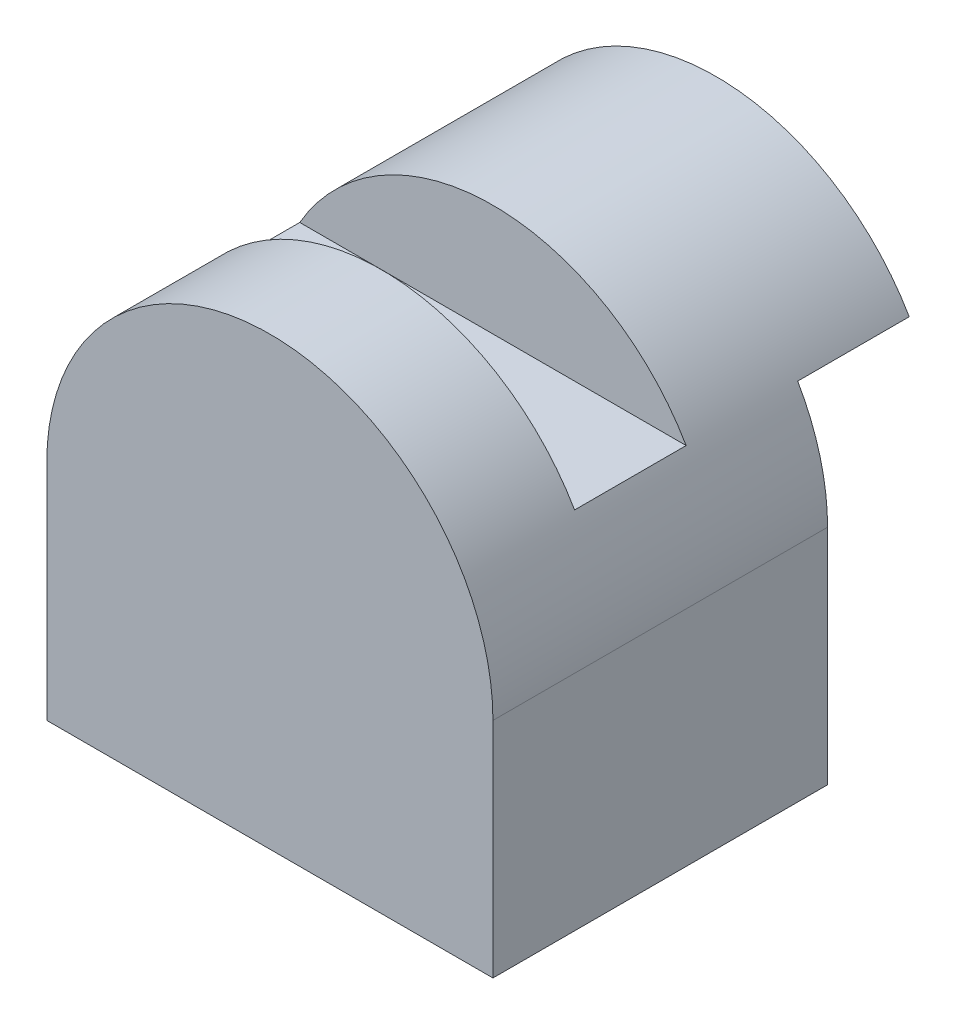
ISO-10303-21;
HEADER;
FILE_DESCRIPTION(('STEP AP214'),'2;1');
FILE_NAME('part.step','',(''),(''),'','','');
FILE_SCHEMA(('AUTOMOTIVE_DESIGN { 1 0 10303 214 1 1 1 1 }'));
ENDSEC;
DATA;
#1=APPLICATION_CONTEXT('core data for automotive mechanical design processes');
#2=APPLICATION_PROTOCOL_DEFINITION('international standard','automotive_design',2000,#1);
#3=PRODUCT_CONTEXT('',#1,'mechanical');
#4=PRODUCT('Part','Part','',(#3));
#5=PRODUCT_RELATED_PRODUCT_CATEGORY('part','',(#4));
#6=PRODUCT_DEFINITION_FORMATION('','',#4);
#7=PRODUCT_DEFINITION_CONTEXT('part definition',#1,'design');
#8=PRODUCT_DEFINITION('design','',#6,#7);
#9=PRODUCT_DEFINITION_SHAPE('','',#8);
#10=(LENGTH_UNIT() NAMED_UNIT(*) SI_UNIT(.MILLI.,.METRE.));
#11=(NAMED_UNIT(*) PLANE_ANGLE_UNIT() SI_UNIT($,.RADIAN.));
#12=(NAMED_UNIT(*) SI_UNIT($,.STERADIAN.) SOLID_ANGLE_UNIT());
#13=UNCERTAINTY_MEASURE_WITH_UNIT(LENGTH_MEASURE(1.E-05),#10,'distance_accuracy_value','');
#14=(GEOMETRIC_REPRESENTATION_CONTEXT(3) GLOBAL_UNCERTAINTY_ASSIGNED_CONTEXT((#13)) GLOBAL_UNIT_ASSIGNED_CONTEXT((#10,
#11,#12)) REPRESENTATION_CONTEXT('',''));
#15=CARTESIAN_POINT('',(0.,0.,0.));
#16=DIRECTION('',(0.,0.,1.));
#17=DIRECTION('',(1.,0.,0.));
#18=AXIS2_PLACEMENT_3D('',#15,#16,#17);
#19=CARTESIAN_POINT('',(0.,0.,40.));
#20=DIRECTION('',(0.,0.,-1.));
#21=DIRECTION('',(-1.,0.,0.));
#22=AXIS2_PLACEMENT_3D('',#19,#20,#21);
#23=CYLINDRICAL_SURFACE('',#22,20.);
#24=DIRECTION('',(0.,0.,-1.));
#25=VECTOR('',#24,1.);
#26=CARTESIAN_POINT('',(17.3205080756888,9.99999999999999,40.));
#27=LINE('',#26,#25);
#28=CARTESIAN_POINT('',(17.3205080756888,9.99999999999999,0.));
#29=VERTEX_POINT('',#28);
#30=CARTESIAN_POINT('',(17.3205080756888,9.99999999999999,10.));
#31=VERTEX_POINT('',#30);
#32=EDGE_CURVE('E147',#29,#31,#27,.F.);
#33=ORIENTED_EDGE('',*,*,#32,.F.);
#34=CARTESIAN_POINT('',(0.,0.,0.));
#35=DIRECTION('',(0.,0.,1.));
#36=DIRECTION('',(-1.,0.,0.));
#37=AXIS2_PLACEMENT_3D('',#34,#35,#36);
#38=CIRCLE('',#37,20.);
#39=CARTESIAN_POINT('',(-17.3205080756888,9.99999999999999,0.));
#40=VERTEX_POINT('',#39);
#41=EDGE_CURVE('E130',#29,#40,#38,.T.);
#42=ORIENTED_EDGE('',*,*,#41,.T.);
#43=DIRECTION('',(0.,0.,-1.));
#44=VECTOR('',#43,1.);
#45=CARTESIAN_POINT('',(-17.3205080756888,9.99999999999999,40.));
#46=LINE('',#45,#44);
#47=CARTESIAN_POINT('',(-17.3205080756888,9.99999999999999,10.));
#48=VERTEX_POINT('',#47);
#49=EDGE_CURVE('E54',#48,#40,#46,.T.);
#50=ORIENTED_EDGE('',*,*,#49,.F.);
#51=CARTESIAN_POINT('',(0.,0.,10.));
#52=DIRECTION('',(0.,0.,-1.));
#53=DIRECTION('',(-1.,0.,0.));
#54=AXIS2_PLACEMENT_3D('',#51,#52,#53);
#55=CIRCLE('',#54,20.);
#56=CARTESIAN_POINT('',(-20.,0.,10.));
#57=VERTEX_POINT('',#56);
#58=EDGE_CURVE('E134',#57,#48,#55,.T.);
#59=ORIENTED_EDGE('',*,*,#58,.F.);
#60=DIRECTION('',(0.,0.,-1.));
#61=VECTOR('',#60,1.);
#62=CARTESIAN_POINT('',(-20.,0.,40.));
#63=LINE('',#62,#61);
#64=CARTESIAN_POINT('',(-20.,0.,40.));
#65=VERTEX_POINT('',#64);
#66=EDGE_CURVE('E117',#65,#57,#63,.T.);
#67=ORIENTED_EDGE('',*,*,#66,.F.);
#68=CARTESIAN_POINT('',(0.,0.,40.));
#69=DIRECTION('',(0.,0.,1.));
#70=DIRECTION('',(-1.,0.,0.));
#71=AXIS2_PLACEMENT_3D('',#68,#69,#70);
#72=CIRCLE('',#71,20.);
#73=CARTESIAN_POINT('',(20.,0.,40.));
#74=VERTEX_POINT('',#73);
#75=EDGE_CURVE('E133',#74,#65,#72,.T.);
#76=ORIENTED_EDGE('',*,*,#75,.F.);
#77=DIRECTION('',(0.,0.,-1.));
#78=VECTOR('',#77,1.);
#79=CARTESIAN_POINT('',(20.,0.,40.));
#80=LINE('',#79,#78);
#81=CARTESIAN_POINT('',(20.,0.,10.));
#82=VERTEX_POINT('',#81);
#83=EDGE_CURVE('E126',#74,#82,#80,.T.);
#84=ORIENTED_EDGE('',*,*,#83,.T.);
#85=EDGE_CURVE('E144',#31,#82,#55,.T.);
#86=ORIENTED_EDGE('',*,*,#85,.F.);
#87=EDGE_LOOP('',(#33,#42,#50,#59,#67,#76,#84,#86));
#88=FACE_BOUND('',#87,.T.);
#89=DIRECTION('',(0.,0.,-1.));
#90=VECTOR('',#89,1.);
#91=CARTESIAN_POINT('',(17.3205080756888,10.,40.));
#92=LINE('',#91,#90);
#93=CARTESIAN_POINT('',(17.3205080756888,10.,30.));
#94=VERTEX_POINT('',#93);
#95=CARTESIAN_POINT('',(17.3205080756888,10.,20.));
#96=VERTEX_POINT('',#95);
#97=EDGE_CURVE('E11',#94,#96,#92,.T.);
#98=ORIENTED_EDGE('',*,*,#97,.F.);
#99=CARTESIAN_POINT('',(0.,0.,30.));
#100=DIRECTION('',(0.,0.,-1.));
#101=DIRECTION('',(0.,1.,0.));
#102=AXIS2_PLACEMENT_3D('',#99,#100,#101);
#103=CIRCLE('',#102,20.);
#104=CARTESIAN_POINT('',(-17.3205080756888,10.,30.));
#105=VERTEX_POINT('',#104);
#106=EDGE_CURVE('E98',#105,#94,#103,.T.);
#107=ORIENTED_EDGE('',*,*,#106,.F.);
#108=DIRECTION('',(0.,0.,-1.));
#109=VECTOR('',#108,1.);
#110=CARTESIAN_POINT('',(-17.3205080756888,10.,40.));
#111=LINE('',#110,#109);
#112=CARTESIAN_POINT('',(-17.3205080756888,10.,20.));
#113=VERTEX_POINT('',#112);
#114=EDGE_CURVE('E105',#113,#105,#111,.F.);
#115=ORIENTED_EDGE('',*,*,#114,.F.);
#116=CARTESIAN_POINT('',(0.,0.,20.));
#117=DIRECTION('',(0.,0.,1.));
#118=DIRECTION('',(1.,0.,0.));
#119=AXIS2_PLACEMENT_3D('',#116,#117,#118);
#120=CIRCLE('',#119,20.);
#121=EDGE_CURVE('E40',#96,#113,#120,.T.);
#122=ORIENTED_EDGE('',*,*,#121,.F.);
#123=EDGE_LOOP('',(#98,#107,#115,#122));
#124=FACE_BOUND('',#123,.T.);
#125=ADVANCED_FACE('F33',(#88,#124),#23,.T.);
#126=CARTESIAN_POINT('',(-20.,0.,40.));
#127=DIRECTION('',(1.,0.,0.));
#128=DIRECTION('',(0.,0.,-1.));
#129=AXIS2_PLACEMENT_3D('',#126,#127,#128);
#130=PLANE('',#129);
#131=DIRECTION('',(0.,1.,0.));
#132=VECTOR('',#131,1.);
#133=CARTESIAN_POINT('',(-20.,0.,10.));
#134=LINE('',#133,#132);
#135=CARTESIAN_POINT('',(-20.,-20.,10.));
#136=VERTEX_POINT('',#135);
#137=EDGE_CURVE('E142',#136,#57,#134,.T.);
#138=ORIENTED_EDGE('',*,*,#137,.F.);
#139=DIRECTION('',(0.,0.,-1.));
#140=VECTOR('',#139,1.);
#141=CARTESIAN_POINT('',(-20.,-20.,40.));
#142=LINE('',#141,#140);
#143=CARTESIAN_POINT('',(-20.,-20.,40.));
#144=VERTEX_POINT('',#143);
#145=EDGE_CURVE('E120',#144,#136,#142,.T.);
#146=ORIENTED_EDGE('',*,*,#145,.F.);
#147=DIRECTION('',(0.,-1.,0.));
#148=VECTOR('',#147,1.);
#149=CARTESIAN_POINT('',(-20.,0.,40.));
#150=LINE('',#149,#148);
#151=EDGE_CURVE('E138',#65,#144,#150,.T.);
#152=ORIENTED_EDGE('',*,*,#151,.F.);
#153=ORIENTED_EDGE('',*,*,#66,.T.);
#154=EDGE_LOOP('',(#138,#146,#152,#153));
#155=FACE_BOUND('',#154,.T.);
#156=ADVANCED_FACE('F162',(#155),#130,.F.);
#157=CARTESIAN_POINT('',(-20.,-20.,40.));
#158=DIRECTION('',(0.,1.,0.));
#159=DIRECTION('',(0.,0.,1.));
#160=AXIS2_PLACEMENT_3D('',#157,#158,#159);
#161=PLANE('',#160);
#162=DIRECTION('',(-1.,0.,0.));
#163=VECTOR('',#162,1.);
#164=CARTESIAN_POINT('',(40.,-20.,10.));
#165=LINE('',#164,#163);
#166=CARTESIAN_POINT('',(20.,-20.,10.));
#167=VERTEX_POINT('',#166);
#168=EDGE_CURVE('E108',#167,#136,#165,.T.);
#169=ORIENTED_EDGE('',*,*,#168,.F.);
#170=DIRECTION('',(0.,0.,-1.));
#171=VECTOR('',#170,1.);
#172=CARTESIAN_POINT('',(20.,-20.,40.));
#173=LINE('',#172,#171);
#174=CARTESIAN_POINT('',(20.,-20.,40.));
#175=VERTEX_POINT('',#174);
#176=EDGE_CURVE('E123',#175,#167,#173,.T.);
#177=ORIENTED_EDGE('',*,*,#176,.F.);
#178=DIRECTION('',(1.,0.,0.));
#179=VECTOR('',#178,1.);
#180=CARTESIAN_POINT('',(-20.,-20.,40.));
#181=LINE('',#180,#179);
#182=EDGE_CURVE('E136',#144,#175,#181,.T.);
#183=ORIENTED_EDGE('',*,*,#182,.F.);
#184=ORIENTED_EDGE('',*,*,#145,.T.);
#185=EDGE_LOOP('',(#169,#177,#183,#184));
#186=FACE_BOUND('',#185,.T.);
#187=ADVANCED_FACE('F165',(#186),#161,.F.);
#188=CARTESIAN_POINT('',(20.,-20.,40.));
#189=DIRECTION('',(-1.,0.,0.));
#190=DIRECTION('',(0.,-1.,0.));
#191=AXIS2_PLACEMENT_3D('',#188,#189,#190);
#192=PLANE('',#191);
#193=DIRECTION('',(0.,-1.,0.));
#194=VECTOR('',#193,1.);
#195=CARTESIAN_POINT('',(20.,-20.,10.));
#196=LINE('',#195,#194);
#197=EDGE_CURVE('E113',#82,#167,#196,.T.);
#198=ORIENTED_EDGE('',*,*,#197,.F.);
#199=ORIENTED_EDGE('',*,*,#83,.F.);
#200=DIRECTION('',(0.,1.,0.));
#201=VECTOR('',#200,1.);
#202=CARTESIAN_POINT('',(20.,-20.,40.));
#203=LINE('',#202,#201);
#204=EDGE_CURVE('E129',#175,#74,#203,.T.);
#205=ORIENTED_EDGE('',*,*,#204,.F.);
#206=ORIENTED_EDGE('',*,*,#176,.T.);
#207=EDGE_LOOP('',(#198,#199,#205,#206));
#208=FACE_BOUND('',#207,.T.);
#209=ADVANCED_FACE('F180',(#208),#192,.F.);
#210=CARTESIAN_POINT('',(0.,0.,0.));
#211=DIRECTION('',(0.,0.,-1.));
#212=DIRECTION('',(-1.,0.,0.));
#213=AXIS2_PLACEMENT_3D('',#210,#211,#212);
#214=PLANE('',#213);
#215=ORIENTED_EDGE('',*,*,#41,.F.);
#216=DIRECTION('',(-1.,0.,0.));
#217=VECTOR('',#216,1.);
#218=CARTESIAN_POINT('',(0.,9.99999999999999,0.));
#219=LINE('',#218,#217);
#220=EDGE_CURVE('E115',#29,#40,#219,.T.);
#221=ORIENTED_EDGE('',*,*,#220,.T.);
#222=EDGE_LOOP('',(#215,#221));
#223=FACE_BOUND('',#222,.T.);
#224=ADVANCED_FACE('F178',(#223),#214,.T.);
#225=CARTESIAN_POINT('',(0.,0.,40.));
#226=DIRECTION('',(0.,0.,-1.));
#227=DIRECTION('',(-1.,0.,0.));
#228=AXIS2_PLACEMENT_3D('',#225,#226,#227);
#229=PLANE('',#228);
#230=ORIENTED_EDGE('',*,*,#75,.T.);
#231=ORIENTED_EDGE('',*,*,#151,.T.);
#232=ORIENTED_EDGE('',*,*,#182,.T.);
#233=ORIENTED_EDGE('',*,*,#204,.T.);
#234=EDGE_LOOP('',(#230,#231,#232,#233));
#235=FACE_BOUND('',#234,.T.);
#236=ADVANCED_FACE('F168',(#235),#229,.F.);
#237=CARTESIAN_POINT('',(40.,-20.,10.));
#238=DIRECTION('',(0.,0.,-1.));
#239=DIRECTION('',(-1.,0.,0.));
#240=AXIS2_PLACEMENT_3D('',#237,#238,#239);
#241=PLANE('',#240);
#242=ORIENTED_EDGE('',*,*,#58,.T.);
#243=DIRECTION('',(-1.,0.,0.));
#244=VECTOR('',#243,1.);
#245=CARTESIAN_POINT('',(40.,9.99999999999999,10.));
#246=LINE('',#245,#244);
#247=EDGE_CURVE('E149',#31,#48,#246,.T.);
#248=ORIENTED_EDGE('',*,*,#247,.F.);
#249=ORIENTED_EDGE('',*,*,#85,.T.);
#250=ORIENTED_EDGE('',*,*,#197,.T.);
#251=ORIENTED_EDGE('',*,*,#168,.T.);
#252=ORIENTED_EDGE('',*,*,#137,.T.);
#253=EDGE_LOOP('',(#242,#248,#249,#250,#251,#252));
#254=FACE_BOUND('',#253,.T.);
#255=ADVANCED_FACE('F155',(#254),#241,.T.);
#256=CARTESIAN_POINT('',(40.,9.99999999999999,0.));
#257=DIRECTION('',(0.,-1.,0.));
#258=DIRECTION('',(0.,0.,-1.));
#259=AXIS2_PLACEMENT_3D('',#256,#257,#258);
#260=PLANE('',#259);
#261=ORIENTED_EDGE('',*,*,#49,.T.);
#262=ORIENTED_EDGE('',*,*,#220,.F.);
#263=ORIENTED_EDGE('',*,*,#32,.T.);
#264=ORIENTED_EDGE('',*,*,#247,.T.);
#265=EDGE_LOOP('',(#261,#262,#263,#264));
#266=FACE_BOUND('',#265,.T.);
#267=ADVANCED_FACE('F175',(#266),#260,.T.);
#268=CARTESIAN_POINT('',(40.,20.,20.));
#269=DIRECTION('',(0.,0.,1.));
#270=DIRECTION('',(1.,0.,0.));
#271=AXIS2_PLACEMENT_3D('',#268,#269,#270);
#272=PLANE('',#271);
#273=DIRECTION('',(-1.,0.,0.));
#274=VECTOR('',#273,1.);
#275=CARTESIAN_POINT('',(40.,10.,20.));
#276=LINE('',#275,#274);
#277=EDGE_CURVE('E46',#96,#113,#276,.T.);
#278=ORIENTED_EDGE('',*,*,#277,.F.);
#279=ORIENTED_EDGE('',*,*,#121,.T.);
#280=EDGE_LOOP('',(#278,#279));
#281=FACE_BOUND('',#280,.T.);
#282=ADVANCED_FACE('F226',(#281),#272,.T.);
#283=CARTESIAN_POINT('',(40.,20.,30.));
#284=DIRECTION('',(0.,0.,-1.));
#285=DIRECTION('',(0.,1.,0.));
#286=AXIS2_PLACEMENT_3D('',#283,#284,#285);
#287=PLANE('',#286);
#288=ORIENTED_EDGE('',*,*,#106,.T.);
#289=DIRECTION('',(-1.,0.,0.));
#290=VECTOR('',#289,1.);
#291=CARTESIAN_POINT('',(40.,10.,30.));
#292=LINE('',#291,#290);
#293=EDGE_CURVE('E101',#94,#105,#292,.T.);
#294=ORIENTED_EDGE('',*,*,#293,.T.);
#295=EDGE_LOOP('',(#288,#294));
#296=FACE_BOUND('',#295,.T.);
#297=ADVANCED_FACE('F100',(#296),#287,.T.);
#298=CARTESIAN_POINT('',(40.,10.,20.));
#299=DIRECTION('',(0.,1.,0.));
#300=DIRECTION('',(0.,0.,1.));
#301=AXIS2_PLACEMENT_3D('',#298,#299,#300);
#302=PLANE('',#301);
#303=ORIENTED_EDGE('',*,*,#97,.T.);
#304=ORIENTED_EDGE('',*,*,#277,.T.);
#305=ORIENTED_EDGE('',*,*,#114,.T.);
#306=ORIENTED_EDGE('',*,*,#293,.F.);
#307=EDGE_LOOP('',(#303,#304,#305,#306));
#308=FACE_BOUND('',#307,.T.);
#309=ADVANCED_FACE('F107',(#308),#302,.T.);
#310=CLOSED_SHELL('',(#125,#156,#187,#209,#224,#236,#255,#267,#282,#297,#309));
#311=MANIFOLD_SOLID_BREP('B2',#310);
#312=ADVANCED_BREP_SHAPE_REPRESENTATION('',(#18,#311),#14);
#313=SHAPE_DEFINITION_REPRESENTATION(#9,#312);
ENDSEC;
END-ISO-10303-21;
